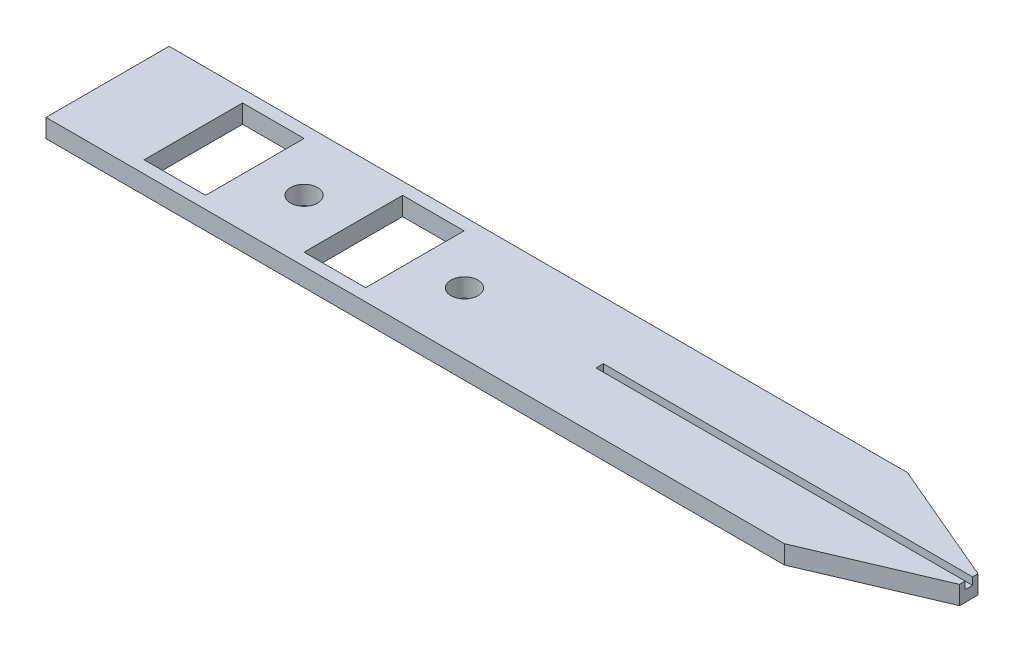
ISO-10303-21;
HEADER;
FILE_DESCRIPTION(('STEP AP214'),'2;1');
FILE_NAME('part.step','',(''),(''),'','','');
FILE_SCHEMA(('AUTOMOTIVE_DESIGN { 1 0 10303 214 1 1 1 1 }'));
ENDSEC;
DATA;
#1=APPLICATION_CONTEXT('core data for automotive mechanical design processes');
#2=APPLICATION_PROTOCOL_DEFINITION('international standard','automotive_design',2000,#1);
#3=PRODUCT_CONTEXT('',#1,'mechanical');
#4=PRODUCT('Part','Part','',(#3));
#5=PRODUCT_RELATED_PRODUCT_CATEGORY('part','',(#4));
#6=PRODUCT_DEFINITION_FORMATION('','',#4);
#7=PRODUCT_DEFINITION_CONTEXT('part definition',#1,'design');
#8=PRODUCT_DEFINITION('design','',#6,#7);
#9=PRODUCT_DEFINITION_SHAPE('','',#8);
#10=(LENGTH_UNIT() NAMED_UNIT(*) SI_UNIT(.MILLI.,.METRE.));
#11=(NAMED_UNIT(*) PLANE_ANGLE_UNIT() SI_UNIT($,.RADIAN.));
#12=(NAMED_UNIT(*) SI_UNIT($,.STERADIAN.) SOLID_ANGLE_UNIT());
#13=UNCERTAINTY_MEASURE_WITH_UNIT(LENGTH_MEASURE(1.E-05),#10,'distance_accuracy_value','');
#14=(GEOMETRIC_REPRESENTATION_CONTEXT(3) GLOBAL_UNCERTAINTY_ASSIGNED_CONTEXT((#13)) GLOBAL_UNIT_ASSIGNED_CONTEXT((#10,
#11,#12)) REPRESENTATION_CONTEXT('',''));
#15=CARTESIAN_POINT('',(0.,0.,0.));
#16=DIRECTION('',(0.,0.,1.));
#17=DIRECTION('',(1.,0.,0.));
#18=AXIS2_PLACEMENT_3D('',#15,#16,#17);
#19=CARTESIAN_POINT('',(65.5801578419851,32.2692901678604,55.4965812895776));
#20=DIRECTION('',(-0.391974070405054,0.,-0.919976264981925));
#21=DIRECTION('',(-0.919976264981925,0.,0.391974070405054));
#22=AXIS2_PLACEMENT_3D('',#19,#20,#21);
#23=PLANE('',#22);
#24=DIRECTION('',(0.919976264981925,0.,-0.391974070405054));
#25=VECTOR('',#24,1.);
#26=CARTESIAN_POINT('',(65.5801578419851,30.7692901678604,55.4965812895776));
#27=LINE('',#26,#25);
#28=CARTESIAN_POINT('',(55.6052655687977,30.7692901678604,59.7465812895776));
#29=VERTEX_POINT('',#28);
#30=CARTESIAN_POINT('',(65.5801578419851,30.7692901678604,55.4965812895776));
#31=VERTEX_POINT('',#30);
#32=EDGE_CURVE('E286',#29,#31,#27,.T.);
#33=ORIENTED_EDGE('',*,*,#32,.T.);
#34=DIRECTION('',(0.,-1.,0.));
#35=VECTOR('',#34,1.);
#36=CARTESIAN_POINT('',(65.5801578419851,32.2692901678604,55.4965812895776));
#37=LINE('',#36,#35);
#38=CARTESIAN_POINT('',(65.5801578419851,32.2692901678604,55.4965812895776));
#39=VERTEX_POINT('',#38);
#40=EDGE_CURVE('E41',#39,#31,#37,.T.);
#41=ORIENTED_EDGE('',*,*,#40,.F.);
#42=DIRECTION('',(0.919976264981925,0.,-0.391974070405054));
#43=VECTOR('',#42,1.);
#44=CARTESIAN_POINT('',(65.5801578419851,32.2692901678604,55.4965812895776));
#45=LINE('',#44,#43);
#46=CARTESIAN_POINT('',(55.6052655687977,32.2692901678604,59.7465812895776));
#47=VERTEX_POINT('',#46);
#48=EDGE_CURVE('E288',#47,#39,#45,.T.);
#49=ORIENTED_EDGE('',*,*,#48,.F.);
#50=DIRECTION('',(0.,-1.,0.));
#51=VECTOR('',#50,1.);
#52=CARTESIAN_POINT('',(55.6052655687977,32.2692901678604,59.7465812895776));
#53=LINE('',#52,#51);
#54=EDGE_CURVE('E297',#47,#29,#53,.T.);
#55=ORIENTED_EDGE('',*,*,#54,.T.);
#56=EDGE_LOOP('',(#33,#41,#49,#55));
#57=FACE_BOUND('',#56,.T.);
#58=ADVANCED_FACE('F34',(#57),#23,.F.);
#59=CARTESIAN_POINT('',(65.5801578419851,32.2692901678604,53.9965812895776));
#60=DIRECTION('',(-1.,0.,0.));
#61=DIRECTION('',(0.,0.,1.));
#62=AXIS2_PLACEMENT_3D('',#59,#60,#61);
#63=PLANE('',#62);
#64=DIRECTION('',(0.,0.,-1.));
#65=VECTOR('',#64,1.);
#66=CARTESIAN_POINT('',(65.5801578419851,31.6692901678604,54.4365812853747));
#67=LINE('',#66,#65);
#68=CARTESIAN_POINT('',(65.5801578419851,31.6692901678604,55.0365812853747));
#69=VERTEX_POINT('',#68);
#70=CARTESIAN_POINT('',(65.5801578419851,31.6692901678604,54.4365812853747));
#71=VERTEX_POINT('',#70);
#72=EDGE_CURVE('E276',#69,#71,#67,.T.);
#73=ORIENTED_EDGE('',*,*,#72,.F.);
#74=DIRECTION('',(0.,1.,0.));
#75=VECTOR('',#74,1.);
#76=CARTESIAN_POINT('',(65.5801578419851,31.6692901678604,55.0365812853747));
#77=LINE('',#76,#75);
#78=CARTESIAN_POINT('',(65.5801578419851,32.2692901678604,55.0365812853747));
#79=VERTEX_POINT('',#78);
#80=EDGE_CURVE('E284',#69,#79,#77,.T.);
#81=ORIENTED_EDGE('',*,*,#80,.T.);
#82=DIRECTION('',(0.,0.,-1.));
#83=VECTOR('',#82,1.);
#84=CARTESIAN_POINT('',(65.5801578419851,32.2692901678604,53.9965812895776));
#85=LINE('',#84,#83);
#86=EDGE_CURVE('E87',#39,#79,#85,.T.);
#87=ORIENTED_EDGE('',*,*,#86,.F.);
#88=ORIENTED_EDGE('',*,*,#40,.T.);
#89=DIRECTION('',(0.,0.,-1.));
#90=VECTOR('',#89,1.);
#91=CARTESIAN_POINT('',(65.5801578419851,30.7692901678604,53.9965812895776));
#92=LINE('',#91,#90);
#93=CARTESIAN_POINT('',(65.5801578419851,30.7692901678604,53.9965812895776));
#94=VERTEX_POINT('',#93);
#95=EDGE_CURVE('E300',#31,#94,#92,.T.);
#96=ORIENTED_EDGE('',*,*,#95,.T.);
#97=DIRECTION('',(0.,-1.,0.));
#98=VECTOR('',#97,1.);
#99=CARTESIAN_POINT('',(65.5801578419851,32.2692901678604,53.9965812895776));
#100=LINE('',#99,#98);
#101=CARTESIAN_POINT('',(65.5801578419851,32.2692901678604,53.9965812895776));
#102=VERTEX_POINT('',#101);
#103=EDGE_CURVE('E311',#102,#94,#100,.T.);
#104=ORIENTED_EDGE('',*,*,#103,.F.);
#105=CARTESIAN_POINT('',(65.5801578419851,32.2692901678604,54.4365812853747));
#106=VERTEX_POINT('',#105);
#107=EDGE_CURVE('E290',#106,#102,#85,.T.);
#108=ORIENTED_EDGE('',*,*,#107,.F.);
#109=DIRECTION('',(0.,1.,0.));
#110=VECTOR('',#109,1.);
#111=CARTESIAN_POINT('',(65.5801578419851,31.6692901678604,54.4365812853747));
#112=LINE('',#111,#110);
#113=EDGE_CURVE('E48',#71,#106,#112,.T.);
#114=ORIENTED_EDGE('',*,*,#113,.F.);
#115=EDGE_LOOP('',(#73,#81,#87,#88,#96,#104,#108,#114));
#116=FACE_BOUND('',#115,.T.);
#117=ADVANCED_FACE('F315',(#116),#63,.F.);
#118=CARTESIAN_POINT('',(65.5801578419851,32.2692901678604,53.9965812895776));
#119=DIRECTION('',(-0.391974070405054,0.,0.919976264981925));
#120=DIRECTION('',(0.919976264981925,0.,0.391974070405054));
#121=AXIS2_PLACEMENT_3D('',#118,#119,#120);
#122=PLANE('',#121);
#123=DIRECTION('',(-0.919976264981925,0.,-0.391974070405054));
#124=VECTOR('',#123,1.);
#125=CARTESIAN_POINT('',(65.5801578419851,30.7692901678604,53.9965812895776));
#126=LINE('',#125,#124);
#127=CARTESIAN_POINT('',(55.6052655687977,30.7692901678604,49.7465812895776));
#128=VERTEX_POINT('',#127);
#129=EDGE_CURVE('E302',#94,#128,#126,.T.);
#130=ORIENTED_EDGE('',*,*,#129,.T.);
#131=DIRECTION('',(0.,-1.,0.));
#132=VECTOR('',#131,1.);
#133=CARTESIAN_POINT('',(55.6052655687977,32.2692901678604,49.7465812895776));
#134=LINE('',#133,#132);
#135=CARTESIAN_POINT('',(55.6052655687977,32.2692901678604,49.7465812895776));
#136=VERTEX_POINT('',#135);
#137=EDGE_CURVE('E308',#136,#128,#134,.T.);
#138=ORIENTED_EDGE('',*,*,#137,.F.);
#139=DIRECTION('',(-0.919976264981925,0.,-0.391974070405054));
#140=VECTOR('',#139,1.);
#141=CARTESIAN_POINT('',(65.5801578419851,32.2692901678604,53.9965812895776));
#142=LINE('',#141,#140);
#143=EDGE_CURVE('E292',#102,#136,#142,.T.);
#144=ORIENTED_EDGE('',*,*,#143,.F.);
#145=ORIENTED_EDGE('',*,*,#103,.T.);
#146=EDGE_LOOP('',(#130,#138,#144,#145));
#147=FACE_BOUND('',#146,.T.);
#148=ADVANCED_FACE('F328',(#147),#122,.F.);
#149=CARTESIAN_POINT('',(45.6052655687977,32.2692901678604,49.7465812895776));
#150=DIRECTION('',(0.,0.,1.));
#151=DIRECTION('',(1.,0.,0.));
#152=AXIS2_PLACEMENT_3D('',#149,#150,#151);
#153=PLANE('',#152);
#154=DIRECTION('',(-1.,0.,0.));
#155=VECTOR('',#154,1.);
#156=CARTESIAN_POINT('',(45.6052655687977,30.7692901678604,49.7465812895776));
#157=LINE('',#156,#155);
#158=CARTESIAN_POINT('',(-4.39473443120233,30.7692901678604,49.7465812895776));
#159=VERTEX_POINT('',#158);
#160=EDGE_CURVE('E304',#128,#159,#157,.T.);
#161=ORIENTED_EDGE('',*,*,#160,.T.);
#162=DIRECTION('',(0.,-1.,0.));
#163=VECTOR('',#162,1.);
#164=CARTESIAN_POINT('',(-4.39473443120233,32.2692901678604,49.7465812895776));
#165=LINE('',#164,#163);
#166=CARTESIAN_POINT('',(-4.39473443120233,32.2692901678604,49.7465812895776));
#167=VERTEX_POINT('',#166);
#168=EDGE_CURVE('E245',#167,#159,#165,.T.);
#169=ORIENTED_EDGE('',*,*,#168,.F.);
#170=DIRECTION('',(-1.,0.,0.));
#171=VECTOR('',#170,1.);
#172=CARTESIAN_POINT('',(45.6052655687977,32.2692901678604,49.7465812895776));
#173=LINE('',#172,#171);
#174=EDGE_CURVE('E294',#136,#167,#173,.T.);
#175=ORIENTED_EDGE('',*,*,#174,.F.);
#176=ORIENTED_EDGE('',*,*,#137,.T.);
#177=EDGE_LOOP('',(#161,#169,#175,#176));
#178=FACE_BOUND('',#177,.T.);
#179=ADVANCED_FACE('F332',(#178),#153,.F.);
#180=CARTESIAN_POINT('',(45.6052655687977,32.2692901678604,59.7465812895776));
#181=DIRECTION('',(0.,0.,-1.));
#182=DIRECTION('',(-1.,0.,0.));
#183=AXIS2_PLACEMENT_3D('',#180,#181,#182);
#184=PLANE('',#183);
#185=DIRECTION('',(1.,0.,0.));
#186=VECTOR('',#185,1.);
#187=CARTESIAN_POINT('',(45.6052655687977,30.7692901678604,59.7465812895776));
#188=LINE('',#187,#186);
#189=CARTESIAN_POINT('',(-4.39473443120233,30.7692901678604,59.7465812895776));
#190=VERTEX_POINT('',#189);
#191=EDGE_CURVE('E79',#190,#29,#188,.T.);
#192=ORIENTED_EDGE('',*,*,#191,.T.);
#193=ORIENTED_EDGE('',*,*,#54,.F.);
#194=DIRECTION('',(1.,0.,0.));
#195=VECTOR('',#194,1.);
#196=CARTESIAN_POINT('',(45.6052655687977,32.2692901678604,59.7465812895776));
#197=LINE('',#196,#195);
#198=CARTESIAN_POINT('',(-4.39473443120233,32.2692901678604,59.7465812895776));
#199=VERTEX_POINT('',#198);
#200=EDGE_CURVE('E57',#199,#47,#197,.T.);
#201=ORIENTED_EDGE('',*,*,#200,.F.);
#202=DIRECTION('',(0.,-1.,0.));
#203=VECTOR('',#202,1.);
#204=CARTESIAN_POINT('',(-4.39473443120233,32.2692901678604,59.7465812895776));
#205=LINE('',#204,#203);
#206=EDGE_CURVE('E241',#199,#190,#205,.T.);
#207=ORIENTED_EDGE('',*,*,#206,.T.);
#208=EDGE_LOOP('',(#192,#193,#201,#207));
#209=FACE_BOUND('',#208,.T.);
#210=ADVANCED_FACE('F372',(#209),#184,.F.);
#211=CARTESIAN_POINT('',(50.6052655687977,32.2692901678604,54.7465812895776));
#212=DIRECTION('',(0.,1.,0.));
#213=DIRECTION('',(0.,0.,1.));
#214=AXIS2_PLACEMENT_3D('',#211,#212,#213);
#215=PLANE('',#214);
#216=DIRECTION('',(-1.,0.,0.));
#217=VECTOR('',#216,1.);
#218=CARTESIAN_POINT('',(35.5801578419851,32.2692901678604,54.4365812853747));
#219=LINE('',#218,#217);
#220=CARTESIAN_POINT('',(35.5801578419851,32.2692901678604,54.4365812853747));
#221=VERTEX_POINT('',#220);
#222=EDGE_CURVE('E271',#106,#221,#219,.T.);
#223=ORIENTED_EDGE('',*,*,#222,.F.);
#224=ORIENTED_EDGE('',*,*,#107,.T.);
#225=ORIENTED_EDGE('',*,*,#143,.T.);
#226=ORIENTED_EDGE('',*,*,#174,.T.);
#227=DIRECTION('',(0.,0.,1.));
#228=VECTOR('',#227,1.);
#229=CARTESIAN_POINT('',(-4.39473443120233,32.2692901678604,49.7465812895776));
#230=LINE('',#229,#228);
#231=EDGE_CURVE('E239',#167,#199,#230,.T.);
#232=ORIENTED_EDGE('',*,*,#231,.T.);
#233=ORIENTED_EDGE('',*,*,#200,.T.);
#234=ORIENTED_EDGE('',*,*,#48,.T.);
#235=ORIENTED_EDGE('',*,*,#86,.T.);
#236=DIRECTION('',(1.,0.,0.));
#237=VECTOR('',#236,1.);
#238=CARTESIAN_POINT('',(50.6052655687977,32.2692901678604,55.0365812853747));
#239=LINE('',#238,#237);
#240=CARTESIAN_POINT('',(35.5801578419851,32.2692901678604,55.0365812853747));
#241=VERTEX_POINT('',#240);
#242=EDGE_CURVE('E11',#241,#79,#239,.T.);
#243=ORIENTED_EDGE('',*,*,#242,.F.);
#244=DIRECTION('',(0.,0.,1.));
#245=VECTOR('',#244,1.);
#246=CARTESIAN_POINT('',(35.5801578419851,32.2692901678604,54.4365812853747));
#247=LINE('',#246,#245);
#248=EDGE_CURVE('E220',#221,#241,#247,.T.);
#249=ORIENTED_EDGE('',*,*,#248,.F.);
#250=EDGE_LOOP('',(#223,#224,#225,#226,#232,#233,#234,#235,#243,#249));
#251=FACE_BOUND('',#250,.T.);
#252=CARTESIAN_POINT('',(24.6052655687977,32.2692901678604,54.7465812895776));
#253=DIRECTION('',(0.,1.,0.));
#254=DIRECTION('',(0.,0.,1.));
#255=AXIS2_PLACEMENT_3D('',#252,#253,#254);
#256=CIRCLE('',#255,1.1);
#257=CARTESIAN_POINT('',(24.6052655687977,32.2692901678604,55.8465812895776));
#258=VERTEX_POINT('',#257);
#259=EDGE_CURVE('E275',#258,#258,#256,.T.);
#260=ORIENTED_EDGE('',*,*,#259,.F.);
#261=EDGE_LOOP('',(#260));
#262=FACE_BOUND('',#261,.T.);
#263=DIRECTION('',(1.,0.,0.));
#264=VECTOR('',#263,1.);
#265=CARTESIAN_POINT('',(15.5752655687977,32.2692901678604,58.7465812895776));
#266=LINE('',#265,#264);
#267=CARTESIAN_POINT('',(15.5752655687977,32.2692901678604,58.7465812895776));
#268=VERTEX_POINT('',#267);
#269=CARTESIAN_POINT('',(20.5752655687977,32.2692901678604,58.7465812895776));
#270=VERTEX_POINT('',#269);
#271=EDGE_CURVE('E188',#268,#270,#266,.T.);
#272=ORIENTED_EDGE('',*,*,#271,.F.);
#273=DIRECTION('',(0.,0.,1.));
#274=VECTOR('',#273,1.);
#275=CARTESIAN_POINT('',(15.5752655687977,32.2692901678604,50.7465812895776));
#276=LINE('',#275,#274);
#277=CARTESIAN_POINT('',(15.5752655687977,32.2692901678604,50.7465812895776));
#278=VERTEX_POINT('',#277);
#279=EDGE_CURVE('E193',#278,#268,#276,.T.);
#280=ORIENTED_EDGE('',*,*,#279,.F.);
#281=DIRECTION('',(-1.,0.,0.));
#282=VECTOR('',#281,1.);
#283=CARTESIAN_POINT('',(15.5752655687977,32.2692901678604,50.7465812895776));
#284=LINE('',#283,#282);
#285=CARTESIAN_POINT('',(20.5752655687977,32.2692901678604,50.7465812895776));
#286=VERTEX_POINT('',#285);
#287=EDGE_CURVE('E172',#286,#278,#284,.T.);
#288=ORIENTED_EDGE('',*,*,#287,.F.);
#289=DIRECTION('',(0.,0.,-1.));
#290=VECTOR('',#289,1.);
#291=CARTESIAN_POINT('',(20.5752655687977,32.2692901678604,58.7465812895776));
#292=LINE('',#291,#290);
#293=EDGE_CURVE('E183',#270,#286,#292,.T.);
#294=ORIENTED_EDGE('',*,*,#293,.F.);
#295=EDGE_LOOP('',(#272,#280,#288,#294));
#296=FACE_BOUND('',#295,.T.);
#297=CARTESIAN_POINT('',(11.5752655687977,32.2692901678604,54.7465812895776));
#298=DIRECTION('',(0.,1.,0.));
#299=DIRECTION('',(0.,0.,1.));
#300=AXIS2_PLACEMENT_3D('',#297,#298,#299);
#301=CIRCLE('',#300,1.1);
#302=CARTESIAN_POINT('',(11.5752655687977,32.2692901678604,55.8465812895776));
#303=VERTEX_POINT('',#302);
#304=EDGE_CURVE('E200',#303,#303,#301,.T.);
#305=ORIENTED_EDGE('',*,*,#304,.F.);
#306=EDGE_LOOP('',(#305));
#307=FACE_BOUND('',#306,.T.);
#308=DIRECTION('',(1.,0.,0.));
#309=VECTOR('',#308,1.);
#310=CARTESIAN_POINT('',(2.57526556879767,32.2692901678604,58.7465812895776));
#311=LINE('',#310,#309);
#312=CARTESIAN_POINT('',(2.57526556879767,32.2692901678604,58.7465812895776));
#313=VERTEX_POINT('',#312);
#314=CARTESIAN_POINT('',(7.57526556879766,32.2692901678604,58.7465812895776));
#315=VERTEX_POINT('',#314);
#316=EDGE_CURVE('E206',#313,#315,#311,.T.);
#317=ORIENTED_EDGE('',*,*,#316,.F.);
#318=DIRECTION('',(0.,0.,1.));
#319=VECTOR('',#318,1.);
#320=CARTESIAN_POINT('',(2.57526556879766,32.2692901678604,50.7465812895776));
#321=LINE('',#320,#319);
#322=CARTESIAN_POINT('',(2.57526556879766,32.2692901678604,50.7465812895776));
#323=VERTEX_POINT('',#322);
#324=EDGE_CURVE('E214',#323,#313,#321,.T.);
#325=ORIENTED_EDGE('',*,*,#324,.F.);
#326=DIRECTION('',(-1.,0.,0.));
#327=VECTOR('',#326,1.);
#328=CARTESIAN_POINT('',(2.57526556879766,32.2692901678604,50.7465812895776));
#329=LINE('',#328,#327);
#330=CARTESIAN_POINT('',(7.57526556879766,32.2692901678604,50.7465812895776));
#331=VERTEX_POINT('',#330);
#332=EDGE_CURVE('E211',#331,#323,#329,.T.);
#333=ORIENTED_EDGE('',*,*,#332,.F.);
#334=DIRECTION('',(0.,0.,-1.));
#335=VECTOR('',#334,1.);
#336=CARTESIAN_POINT('',(7.57526556879766,32.2692901678604,58.7465812895776));
#337=LINE('',#336,#335);
#338=EDGE_CURVE('E208',#315,#331,#337,.T.);
#339=ORIENTED_EDGE('',*,*,#338,.F.);
#340=EDGE_LOOP('',(#317,#325,#333,#339));
#341=FACE_BOUND('',#340,.T.);
#342=ADVANCED_FACE('F190',(#251,#262,#296,#307,#341),#215,.T.);
#343=CARTESIAN_POINT('',(50.6052655687977,30.7692901678604,54.7465812895776));
#344=DIRECTION('',(0.,1.,0.));
#345=DIRECTION('',(0.,0.,1.));
#346=AXIS2_PLACEMENT_3D('',#343,#344,#345);
#347=PLANE('',#346);
#348=ORIENTED_EDGE('',*,*,#32,.F.);
#349=ORIENTED_EDGE('',*,*,#191,.F.);
#350=DIRECTION('',(0.,0.,1.));
#351=VECTOR('',#350,1.);
#352=CARTESIAN_POINT('',(-4.39473443120233,30.7692901678604,49.7465812895776));
#353=LINE('',#352,#351);
#354=EDGE_CURVE('E236',#159,#190,#353,.T.);
#355=ORIENTED_EDGE('',*,*,#354,.F.);
#356=ORIENTED_EDGE('',*,*,#160,.F.);
#357=ORIENTED_EDGE('',*,*,#129,.F.);
#358=ORIENTED_EDGE('',*,*,#95,.F.);
#359=EDGE_LOOP('',(#348,#349,#355,#356,#357,#358));
#360=FACE_BOUND('',#359,.T.);
#361=CARTESIAN_POINT('',(24.6052655687977,30.7692901678604,54.7465812895776));
#362=DIRECTION('',(0.,1.,0.));
#363=DIRECTION('',(0.,0.,1.));
#364=AXIS2_PLACEMENT_3D('',#361,#362,#363);
#365=CIRCLE('',#364,1.1);
#366=CARTESIAN_POINT('',(24.6052655687977,30.7692901678604,55.8465812895776));
#367=VERTEX_POINT('',#366);
#368=EDGE_CURVE('E272',#367,#367,#365,.T.);
#369=ORIENTED_EDGE('',*,*,#368,.T.);
#370=EDGE_LOOP('',(#369));
#371=FACE_BOUND('',#370,.T.);
#372=DIRECTION('',(0.,0.,1.));
#373=VECTOR('',#372,1.);
#374=CARTESIAN_POINT('',(15.5752655687977,30.7692901678604,54.7465812895776));
#375=LINE('',#374,#373);
#376=CARTESIAN_POINT('',(15.5752655687977,30.7692901678604,50.7465812895776));
#377=VERTEX_POINT('',#376);
#378=CARTESIAN_POINT('',(15.5752655687977,30.7692901678604,58.7465812895776));
#379=VERTEX_POINT('',#378);
#380=EDGE_CURVE('E265',#377,#379,#375,.T.);
#381=ORIENTED_EDGE('',*,*,#380,.T.);
#382=DIRECTION('',(1.,0.,0.));
#383=VECTOR('',#382,1.);
#384=CARTESIAN_POINT('',(20.6052655687977,30.7692901678604,58.7465812895776));
#385=LINE('',#384,#383);
#386=CARTESIAN_POINT('',(20.5752655687977,30.7692901678604,58.7465812895776));
#387=VERTEX_POINT('',#386);
#388=EDGE_CURVE('E268',#379,#387,#385,.T.);
#389=ORIENTED_EDGE('',*,*,#388,.T.);
#390=DIRECTION('',(0.,0.,-1.));
#391=VECTOR('',#390,1.);
#392=CARTESIAN_POINT('',(20.5752655687977,30.7692901678604,54.7465812895776));
#393=LINE('',#392,#391);
#394=CARTESIAN_POINT('',(20.5752655687977,30.7692901678604,50.7465812895776));
#395=VERTEX_POINT('',#394);
#396=EDGE_CURVE('E260',#387,#395,#393,.T.);
#397=ORIENTED_EDGE('',*,*,#396,.T.);
#398=DIRECTION('',(-1.,0.,0.));
#399=VECTOR('',#398,1.);
#400=CARTESIAN_POINT('',(20.6052655687977,30.7692901678604,50.7465812895776));
#401=LINE('',#400,#399);
#402=EDGE_CURVE('E175',#395,#377,#401,.T.);
#403=ORIENTED_EDGE('',*,*,#402,.T.);
#404=EDGE_LOOP('',(#381,#389,#397,#403));
#405=FACE_BOUND('',#404,.T.);
#406=CARTESIAN_POINT('',(11.5752655687977,30.7692901678604,54.7465812895776));
#407=DIRECTION('',(0.,1.,0.));
#408=DIRECTION('',(0.,0.,1.));
#409=AXIS2_PLACEMENT_3D('',#406,#407,#408);
#410=CIRCLE('',#409,1.1);
#411=CARTESIAN_POINT('',(11.5752655687977,30.7692901678604,55.8465812895776));
#412=VERTEX_POINT('',#411);
#413=EDGE_CURVE('E205',#412,#412,#410,.T.);
#414=ORIENTED_EDGE('',*,*,#413,.T.);
#415=EDGE_LOOP('',(#414));
#416=FACE_BOUND('',#415,.T.);
#417=DIRECTION('',(0.,0.,1.));
#418=VECTOR('',#417,1.);
#419=CARTESIAN_POINT('',(2.57526556879766,30.7692901678604,54.7465812895776));
#420=LINE('',#419,#418);
#421=CARTESIAN_POINT('',(2.57526556879766,30.7692901678604,50.7465812895776));
#422=VERTEX_POINT('',#421);
#423=CARTESIAN_POINT('',(2.57526556879767,30.7692901678604,58.7465812895776));
#424=VERTEX_POINT('',#423);
#425=EDGE_CURVE('E254',#422,#424,#420,.T.);
#426=ORIENTED_EDGE('',*,*,#425,.T.);
#427=DIRECTION('',(1.,0.,0.));
#428=VECTOR('',#427,1.);
#429=CARTESIAN_POINT('',(20.6052655687977,30.7692901678604,58.7465812895776));
#430=LINE('',#429,#428);
#431=CARTESIAN_POINT('',(7.57526556879766,30.7692901678604,58.7465812895776));
#432=VERTEX_POINT('',#431);
#433=EDGE_CURVE('E257',#424,#432,#430,.T.);
#434=ORIENTED_EDGE('',*,*,#433,.T.);
#435=DIRECTION('',(0.,0.,-1.));
#436=VECTOR('',#435,1.);
#437=CARTESIAN_POINT('',(7.57526556879766,30.7692901678604,54.7465812895776));
#438=LINE('',#437,#436);
#439=CARTESIAN_POINT('',(7.57526556879766,30.7692901678604,50.7465812895776));
#440=VERTEX_POINT('',#439);
#441=EDGE_CURVE('E248',#432,#440,#438,.T.);
#442=ORIENTED_EDGE('',*,*,#441,.T.);
#443=DIRECTION('',(-1.,0.,0.));
#444=VECTOR('',#443,1.);
#445=CARTESIAN_POINT('',(20.6052655687977,30.7692901678604,50.7465812895776));
#446=LINE('',#445,#444);
#447=EDGE_CURVE('E251',#440,#422,#446,.T.);
#448=ORIENTED_EDGE('',*,*,#447,.T.);
#449=EDGE_LOOP('',(#426,#434,#442,#448));
#450=FACE_BOUND('',#449,.T.);
#451=ADVANCED_FACE('F321',(#360,#371,#405,#416,#450),#347,.F.);
#452=CARTESIAN_POINT('',(8.56861161537381,31.6692901678604,-1.14667946462532));
#453=DIRECTION('',(0.,1.,0.));
#454=DIRECTION('',(0.,0.,1.));
#455=AXIS2_PLACEMENT_3D('',#452,#453,#454);
#456=PLANE('',#455);
#457=DIRECTION('',(-1.,0.,0.));
#458=VECTOR('',#457,1.);
#459=CARTESIAN_POINT('',(35.5801578419851,31.6692901678604,54.4365812853747));
#460=LINE('',#459,#458);
#461=CARTESIAN_POINT('',(35.5801578419851,31.6692901678604,54.4365812853747));
#462=VERTEX_POINT('',#461);
#463=EDGE_CURVE('E279',#71,#462,#460,.T.);
#464=ORIENTED_EDGE('',*,*,#463,.T.);
#465=DIRECTION('',(0.,0.,1.));
#466=VECTOR('',#465,1.);
#467=CARTESIAN_POINT('',(35.5801578419851,31.6692901678604,54.4365812853747));
#468=LINE('',#467,#466);
#469=CARTESIAN_POINT('',(35.5801578419851,31.6692901678604,55.0365812853747));
#470=VERTEX_POINT('',#469);
#471=EDGE_CURVE('E227',#462,#470,#468,.T.);
#472=ORIENTED_EDGE('',*,*,#471,.T.);
#473=DIRECTION('',(1.,0.,0.));
#474=VECTOR('',#473,1.);
#475=CARTESIAN_POINT('',(35.5801578419851,31.6692901678604,55.0365812853747));
#476=LINE('',#475,#474);
#477=EDGE_CURVE('E281',#470,#69,#476,.T.);
#478=ORIENTED_EDGE('',*,*,#477,.T.);
#479=ORIENTED_EDGE('',*,*,#72,.T.);
#480=EDGE_LOOP('',(#464,#472,#478,#479));
#481=FACE_BOUND('',#480,.T.);
#482=ADVANCED_FACE('F341',(#481),#456,.T.);
#483=CARTESIAN_POINT('',(35.5801578419851,31.6692901678604,55.0365812853747));
#484=DIRECTION('',(0.,0.,1.));
#485=DIRECTION('',(1.,0.,0.));
#486=AXIS2_PLACEMENT_3D('',#483,#484,#485);
#487=PLANE('',#486);
#488=ORIENTED_EDGE('',*,*,#242,.T.);
#489=ORIENTED_EDGE('',*,*,#80,.F.);
#490=ORIENTED_EDGE('',*,*,#477,.F.);
#491=DIRECTION('',(0.,1.,0.));
#492=VECTOR('',#491,1.);
#493=CARTESIAN_POINT('',(35.5801578419851,31.6692901678604,55.0365812853747));
#494=LINE('',#493,#492);
#495=EDGE_CURVE('E233',#470,#241,#494,.T.);
#496=ORIENTED_EDGE('',*,*,#495,.T.);
#497=EDGE_LOOP('',(#488,#489,#490,#496));
#498=FACE_BOUND('',#497,.T.);
#499=ADVANCED_FACE('F346',(#498),#487,.F.);
#500=CARTESIAN_POINT('',(35.5801578419851,31.6692901678604,54.4365812853747));
#501=DIRECTION('',(0.,0.,-1.));
#502=DIRECTION('',(-1.,0.,0.));
#503=AXIS2_PLACEMENT_3D('',#500,#501,#502);
#504=PLANE('',#503);
#505=ORIENTED_EDGE('',*,*,#463,.F.);
#506=ORIENTED_EDGE('',*,*,#113,.T.);
#507=ORIENTED_EDGE('',*,*,#222,.T.);
#508=DIRECTION('',(0.,1.,0.));
#509=VECTOR('',#508,1.);
#510=CARTESIAN_POINT('',(35.5801578419851,31.6692901678604,54.4365812853747));
#511=LINE('',#510,#509);
#512=EDGE_CURVE('E230',#462,#221,#511,.T.);
#513=ORIENTED_EDGE('',*,*,#512,.F.);
#514=EDGE_LOOP('',(#505,#506,#507,#513));
#515=FACE_BOUND('',#514,.T.);
#516=ADVANCED_FACE('F349',(#515),#504,.F.);
#517=CARTESIAN_POINT('',(-4.39473443120233,32.2692901678604,49.7465812895776));
#518=DIRECTION('',(1.,0.,0.));
#519=DIRECTION('',(0.,0.,-1.));
#520=AXIS2_PLACEMENT_3D('',#517,#518,#519);
#521=PLANE('',#520);
#522=ORIENTED_EDGE('',*,*,#354,.T.);
#523=ORIENTED_EDGE('',*,*,#206,.F.);
#524=ORIENTED_EDGE('',*,*,#231,.F.);
#525=ORIENTED_EDGE('',*,*,#168,.T.);
#526=EDGE_LOOP('',(#522,#523,#524,#525));
#527=FACE_BOUND('',#526,.T.);
#528=ADVANCED_FACE('F351',(#527),#521,.F.);
#529=CARTESIAN_POINT('',(35.5801578419851,31.6692901678604,54.4365812853747));
#530=DIRECTION('',(-1.,0.,0.));
#531=DIRECTION('',(0.,0.,1.));
#532=AXIS2_PLACEMENT_3D('',#529,#530,#531);
#533=PLANE('',#532);
#534=ORIENTED_EDGE('',*,*,#248,.T.);
#535=ORIENTED_EDGE('',*,*,#495,.F.);
#536=ORIENTED_EDGE('',*,*,#471,.F.);
#537=ORIENTED_EDGE('',*,*,#512,.T.);
#538=EDGE_LOOP('',(#534,#535,#536,#537));
#539=FACE_BOUND('',#538,.T.);
#540=ADVANCED_FACE('F348',(#539),#533,.F.);
#541=CARTESIAN_POINT('',(2.57526556879767,22.2692901678604,58.7465812895776));
#542=DIRECTION('',(0.,0.,1.));
#543=DIRECTION('',(1.,0.,0.));
#544=AXIS2_PLACEMENT_3D('',#541,#542,#543);
#545=PLANE('',#544);
#546=DIRECTION('',(0.,1.,0.));
#547=VECTOR('',#546,1.);
#548=CARTESIAN_POINT('',(2.57526556879767,22.2692901678604,58.7465812895776));
#549=LINE('',#548,#547);
#550=EDGE_CURVE('E218',#424,#313,#549,.T.);
#551=ORIENTED_EDGE('',*,*,#550,.T.);
#552=ORIENTED_EDGE('',*,*,#316,.T.);
#553=DIRECTION('',(0.,1.,0.));
#554=VECTOR('',#553,1.);
#555=CARTESIAN_POINT('',(7.57526556879766,22.2692901678604,58.7465812895776));
#556=LINE('',#555,#554);
#557=EDGE_CURVE('E217',#432,#315,#556,.T.);
#558=ORIENTED_EDGE('',*,*,#557,.F.);
#559=ORIENTED_EDGE('',*,*,#433,.F.);
#560=EDGE_LOOP('',(#551,#552,#558,#559));
#561=FACE_BOUND('',#560,.T.);
#562=ADVANCED_FACE('F412',(#561),#545,.F.);
#563=CARTESIAN_POINT('',(2.57526556879766,22.2692901678604,50.7465812895776));
#564=DIRECTION('',(-1.,0.,0.));
#565=DIRECTION('',(0.,0.,1.));
#566=AXIS2_PLACEMENT_3D('',#563,#564,#565);
#567=PLANE('',#566);
#568=DIRECTION('',(0.,1.,0.));
#569=VECTOR('',#568,1.);
#570=CARTESIAN_POINT('',(2.57526556879766,22.2692901678604,50.7465812895776));
#571=LINE('',#570,#569);
#572=EDGE_CURVE('E221',#422,#323,#571,.T.);
#573=ORIENTED_EDGE('',*,*,#572,.T.);
#574=ORIENTED_EDGE('',*,*,#324,.T.);
#575=ORIENTED_EDGE('',*,*,#550,.F.);
#576=ORIENTED_EDGE('',*,*,#425,.F.);
#577=EDGE_LOOP('',(#573,#574,#575,#576));
#578=FACE_BOUND('',#577,.T.);
#579=ADVANCED_FACE('F421',(#578),#567,.F.);
#580=CARTESIAN_POINT('',(2.57526556879766,22.2692901678604,50.7465812895776));
#581=DIRECTION('',(0.,0.,-1.));
#582=DIRECTION('',(-1.,0.,0.));
#583=AXIS2_PLACEMENT_3D('',#580,#581,#582);
#584=PLANE('',#583);
#585=DIRECTION('',(0.,1.,0.));
#586=VECTOR('',#585,1.);
#587=CARTESIAN_POINT('',(7.57526556879766,22.2692901678604,50.7465812895776));
#588=LINE('',#587,#586);
#589=EDGE_CURVE('E223',#440,#331,#588,.T.);
#590=ORIENTED_EDGE('',*,*,#589,.T.);
#591=ORIENTED_EDGE('',*,*,#332,.T.);
#592=ORIENTED_EDGE('',*,*,#572,.F.);
#593=ORIENTED_EDGE('',*,*,#447,.F.);
#594=EDGE_LOOP('',(#590,#591,#592,#593));
#595=FACE_BOUND('',#594,.T.);
#596=ADVANCED_FACE('F431',(#595),#584,.F.);
#597=CARTESIAN_POINT('',(7.57526556879766,22.2692901678604,58.7465812895776));
#598=DIRECTION('',(1.,0.,0.));
#599=DIRECTION('',(0.,0.,-1.));
#600=AXIS2_PLACEMENT_3D('',#597,#598,#599);
#601=PLANE('',#600);
#602=ORIENTED_EDGE('',*,*,#557,.T.);
#603=ORIENTED_EDGE('',*,*,#338,.T.);
#604=ORIENTED_EDGE('',*,*,#589,.F.);
#605=ORIENTED_EDGE('',*,*,#441,.F.);
#606=EDGE_LOOP('',(#602,#603,#604,#605));
#607=FACE_BOUND('',#606,.T.);
#608=ADVANCED_FACE('F441',(#607),#601,.F.);
#609=CARTESIAN_POINT('',(11.5752655687977,22.2692901678604,54.7465812895776));
#610=DIRECTION('',(0.,1.,0.));
#611=DIRECTION('',(0.,0.,1.));
#612=AXIS2_PLACEMENT_3D('',#609,#610,#611);
#613=CYLINDRICAL_SURFACE('',#612,1.1);
#614=ORIENTED_EDGE('',*,*,#304,.T.);
#615=EDGE_LOOP('',(#614));
#616=FACE_BOUND('',#615,.T.);
#617=ORIENTED_EDGE('',*,*,#413,.F.);
#618=EDGE_LOOP('',(#617));
#619=FACE_BOUND('',#618,.T.);
#620=ADVANCED_FACE('F451',(#616,#619),#613,.F.);
#621=CARTESIAN_POINT('',(15.5752655687977,22.2692901678604,58.7465812895776));
#622=DIRECTION('',(0.,0.,1.));
#623=DIRECTION('',(1.,0.,0.));
#624=AXIS2_PLACEMENT_3D('',#621,#622,#623);
#625=PLANE('',#624);
#626=DIRECTION('',(0.,1.,0.));
#627=VECTOR('',#626,1.);
#628=CARTESIAN_POINT('',(15.5752655687977,22.2692901678604,58.7465812895776));
#629=LINE('',#628,#627);
#630=EDGE_CURVE('E198',#379,#268,#629,.T.);
#631=ORIENTED_EDGE('',*,*,#630,.T.);
#632=ORIENTED_EDGE('',*,*,#271,.T.);
#633=DIRECTION('',(0.,1.,0.));
#634=VECTOR('',#633,1.);
#635=CARTESIAN_POINT('',(20.5752655687977,22.2692901678604,58.7465812895776));
#636=LINE('',#635,#634);
#637=EDGE_CURVE('E179',#387,#270,#636,.T.);
#638=ORIENTED_EDGE('',*,*,#637,.F.);
#639=ORIENTED_EDGE('',*,*,#388,.F.);
#640=EDGE_LOOP('',(#631,#632,#638,#639));
#641=FACE_BOUND('',#640,.T.);
#642=ADVANCED_FACE('F461',(#641),#625,.F.);
#643=CARTESIAN_POINT('',(15.5752655687977,22.2692901678604,50.7465812895776));
#644=DIRECTION('',(-1.,0.,0.));
#645=DIRECTION('',(0.,0.,1.));
#646=AXIS2_PLACEMENT_3D('',#643,#644,#645);
#647=PLANE('',#646);
#648=DIRECTION('',(0.,1.,0.));
#649=VECTOR('',#648,1.);
#650=CARTESIAN_POINT('',(15.5752655687977,22.2692901678604,50.7465812895776));
#651=LINE('',#650,#649);
#652=EDGE_CURVE('E178',#377,#278,#651,.T.);
#653=ORIENTED_EDGE('',*,*,#652,.T.);
#654=ORIENTED_EDGE('',*,*,#279,.T.);
#655=ORIENTED_EDGE('',*,*,#630,.F.);
#656=ORIENTED_EDGE('',*,*,#380,.F.);
#657=EDGE_LOOP('',(#653,#654,#655,#656));
#658=FACE_BOUND('',#657,.T.);
#659=ADVANCED_FACE('F471',(#658),#647,.F.);
#660=CARTESIAN_POINT('',(15.5752655687977,22.2692901678604,50.7465812895776));
#661=DIRECTION('',(0.,0.,-1.));
#662=DIRECTION('',(-1.,0.,0.));
#663=AXIS2_PLACEMENT_3D('',#660,#661,#662);
#664=PLANE('',#663);
#665=DIRECTION('',(0.,1.,0.));
#666=VECTOR('',#665,1.);
#667=CARTESIAN_POINT('',(20.5752655687977,22.2692901678604,50.7465812895776));
#668=LINE('',#667,#666);
#669=EDGE_CURVE('E167',#395,#286,#668,.T.);
#670=ORIENTED_EDGE('',*,*,#669,.T.);
#671=ORIENTED_EDGE('',*,*,#287,.T.);
#672=ORIENTED_EDGE('',*,*,#652,.F.);
#673=ORIENTED_EDGE('',*,*,#402,.F.);
#674=EDGE_LOOP('',(#670,#671,#672,#673));
#675=FACE_BOUND('',#674,.T.);
#676=ADVANCED_FACE('F169',(#675),#664,.F.);
#677=CARTESIAN_POINT('',(20.5752655687977,22.2692901678604,58.7465812895776));
#678=DIRECTION('',(1.,0.,0.));
#679=DIRECTION('',(0.,0.,-1.));
#680=AXIS2_PLACEMENT_3D('',#677,#678,#679);
#681=PLANE('',#680);
#682=ORIENTED_EDGE('',*,*,#637,.T.);
#683=ORIENTED_EDGE('',*,*,#293,.T.);
#684=ORIENTED_EDGE('',*,*,#669,.F.);
#685=ORIENTED_EDGE('',*,*,#396,.F.);
#686=EDGE_LOOP('',(#682,#683,#684,#685));
#687=FACE_BOUND('',#686,.T.);
#688=ADVANCED_FACE('F184',(#687),#681,.F.);
#689=CARTESIAN_POINT('',(24.6052655687977,22.2692901678604,54.7465812895776));
#690=DIRECTION('',(0.,1.,0.));
#691=DIRECTION('',(0.,0.,1.));
#692=AXIS2_PLACEMENT_3D('',#689,#690,#691);
#693=CYLINDRICAL_SURFACE('',#692,1.1);
#694=ORIENTED_EDGE('',*,*,#259,.T.);
#695=EDGE_LOOP('',(#694));
#696=FACE_BOUND('',#695,.T.);
#697=ORIENTED_EDGE('',*,*,#368,.F.);
#698=EDGE_LOOP('',(#697));
#699=FACE_BOUND('',#698,.T.);
#700=ADVANCED_FACE('F498',(#696,#699),#693,.F.);
#701=CLOSED_SHELL('',(#58,#117,#148,#179,#210,#342,#451,#482,#499,#516,#528,#540,#562,#579,#596,
#608,#620,#642,#659,#676,#688,#700));
#702=MANIFOLD_SOLID_BREP('B2',#701);
#703=ADVANCED_BREP_SHAPE_REPRESENTATION('',(#18,#702),#14);
#704=SHAPE_DEFINITION_REPRESENTATION(#9,#703);
ENDSEC;
END-ISO-10303-21;
